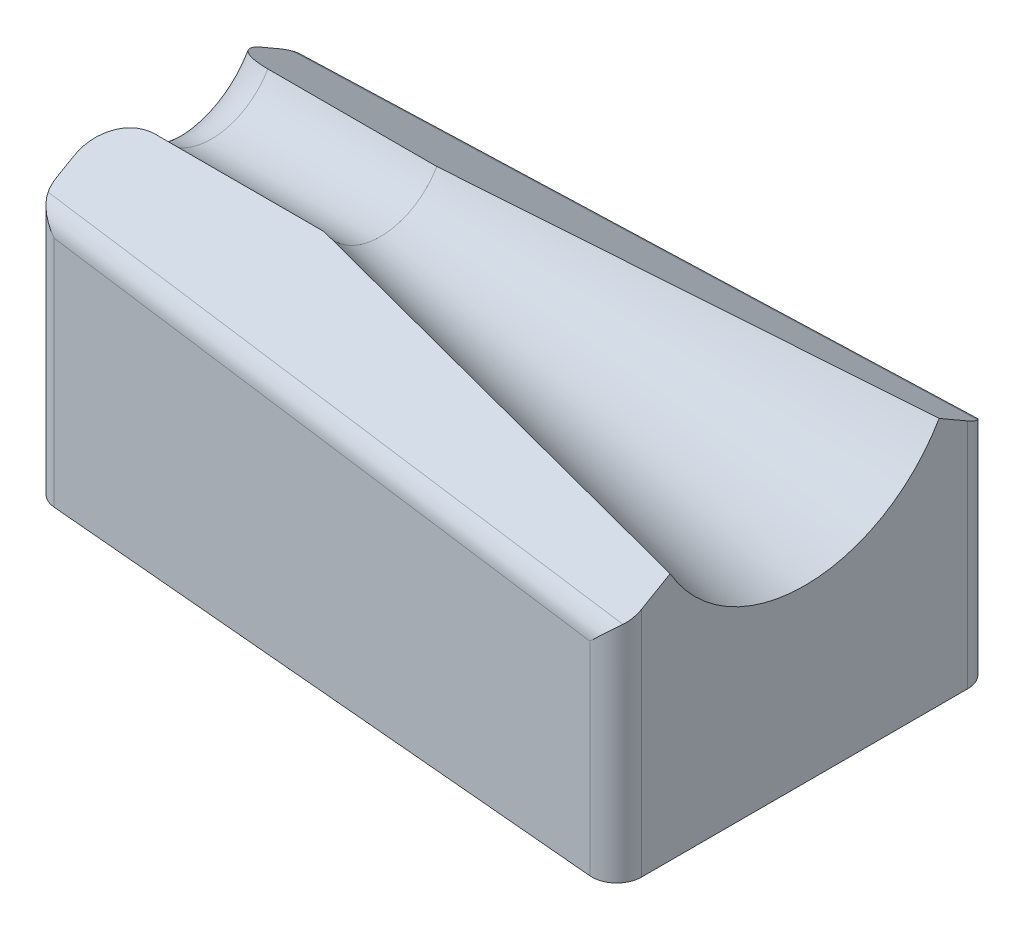
ISO-10303-21;
HEADER;
FILE_DESCRIPTION(('STEP AP214'),'2;1');
FILE_NAME('part.step','',(''),(''),'','','');
FILE_SCHEMA(('AUTOMOTIVE_DESIGN { 1 0 10303 214 1 1 1 1 }'));
ENDSEC;
DATA;
#1=APPLICATION_CONTEXT('core data for automotive mechanical design processes');
#2=APPLICATION_PROTOCOL_DEFINITION('international standard','automotive_design',2000,#1);
#3=PRODUCT_CONTEXT('',#1,'mechanical');
#4=PRODUCT('Part','Part','',(#3));
#5=PRODUCT_RELATED_PRODUCT_CATEGORY('part','',(#4));
#6=PRODUCT_DEFINITION_FORMATION('','',#4);
#7=PRODUCT_DEFINITION_CONTEXT('part definition',#1,'design');
#8=PRODUCT_DEFINITION('design','',#6,#7);
#9=PRODUCT_DEFINITION_SHAPE('','',#8);
#10=(LENGTH_UNIT() NAMED_UNIT(*) SI_UNIT(.MILLI.,.METRE.));
#11=(NAMED_UNIT(*) PLANE_ANGLE_UNIT() SI_UNIT($,.RADIAN.));
#12=(NAMED_UNIT(*) SI_UNIT($,.STERADIAN.) SOLID_ANGLE_UNIT());
#13=UNCERTAINTY_MEASURE_WITH_UNIT(LENGTH_MEASURE(1.E-05),#10,'distance_accuracy_value','');
#14=(GEOMETRIC_REPRESENTATION_CONTEXT(3) GLOBAL_UNCERTAINTY_ASSIGNED_CONTEXT((#13)) GLOBAL_UNIT_ASSIGNED_CONTEXT((#10,
#11,#12)) REPRESENTATION_CONTEXT('',''));
#15=CARTESIAN_POINT('',(0.,0.,0.));
#16=DIRECTION('',(0.,0.,1.));
#17=DIRECTION('',(1.,0.,0.));
#18=AXIS2_PLACEMENT_3D('',#15,#16,#17);
#19=CARTESIAN_POINT('',(103.375792349585,41.7202519652101,0.));
#20=DIRECTION('',(1.,0.,0.));
#21=DIRECTION('',(0.,0.,-1.));
#22=AXIS2_PLACEMENT_3D('',#19,#20,#21);
#23=CONICAL_SURFACE('',#22,31.75,0.20943951023932);
#24=CARTESIAN_POINT('',(16.636959168556,41.7202519652101,0.));
#25=DIRECTION('',(1.,0.,0.));
#26=DIRECTION('',(0.,0.,-1.));
#27=AXIS2_PLACEMENT_3D('',#24,#25,#26);
#28=CIRCLE('',#27,13.3130918557707);
#29=CARTESIAN_POINT('',(16.636959168556,35.0637060373248,11.5294757500131));
#30=VERTEX_POINT('',#29);
#31=CARTESIAN_POINT('',(16.636959168556,35.0637060373248,-11.5294757500131));
#32=VERTEX_POINT('',#31);
#33=EDGE_CURVE('E135',#30,#32,#28,.T.);
#34=ORIENTED_EDGE('',*,*,#33,.F.);
#35=DIRECTION('',(-0.978147600733805,0.10395584540888,-0.180056805991956));
#36=VECTOR('',#35,1.);
#37=CARTESIAN_POINT('',(16.636959168556,35.0637060373248,11.5294757500131));
#38=LINE('',#37,#36);
#39=CARTESIAN_POINT('',(103.375792349585,25.8452519652101,27.496306570156));
#40=VERTEX_POINT('',#39);
#41=EDGE_CURVE('E169',#40,#30,#38,.T.);
#42=ORIENTED_EDGE('',*,*,#41,.F.);
#43=CARTESIAN_POINT('',(103.375792349585,41.7202519652101,0.));
#44=DIRECTION('',(1.,0.,0.));
#45=DIRECTION('',(0.,0.,-1.));
#46=AXIS2_PLACEMENT_3D('',#43,#44,#45);
#47=CIRCLE('',#46,31.75);
#48=CARTESIAN_POINT('',(103.375792349585,25.8452519652101,-27.496306570156));
#49=VERTEX_POINT('',#48);
#50=EDGE_CURVE('E153',#40,#49,#47,.T.);
#51=ORIENTED_EDGE('',*,*,#50,.T.);
#52=DIRECTION('',(-0.978147600733805,0.10395584540888,0.180056805991956));
#53=VECTOR('',#52,1.);
#54=CARTESIAN_POINT('',(16.636959168556,35.0637060373248,-11.5294757500131));
#55=LINE('',#54,#53);
#56=EDGE_CURVE('E151',#49,#32,#55,.T.);
#57=ORIENTED_EDGE('',*,*,#56,.T.);
#58=EDGE_LOOP('',(#34,#42,#51,#57));
#59=FACE_BOUND('',#58,.T.);
#60=ADVANCED_FACE('F33',(#59),#23,.F.);
#61=CARTESIAN_POINT('',(103.375792349585,41.7202519652101,0.));
#62=DIRECTION('',(1.,0.,0.));
#63=DIRECTION('',(0.,0.,-1.));
#64=AXIS2_PLACEMENT_3D('',#61,#62,#63);
#65=CYLINDRICAL_SURFACE('',#64,13.3130918557707);
#66=CARTESIAN_POINT('',(-17.9092076504145,41.7202519652101,0.));
#67=DIRECTION('',(1.,0.,0.));
#68=DIRECTION('',(0.,0.,-1.));
#69=AXIS2_PLACEMENT_3D('',#66,#67,#68);
#70=CIRCLE('',#69,13.3130918557707);
#71=CARTESIAN_POINT('',(-17.9092076504145,35.0637060373248,11.5294757500131));
#72=VERTEX_POINT('',#71);
#73=CARTESIAN_POINT('',(-17.9092076504145,35.0637060373248,-11.5294757500131));
#74=VERTEX_POINT('',#73);
#75=EDGE_CURVE('E147',#72,#74,#70,.T.);
#76=ORIENTED_EDGE('',*,*,#75,.F.);
#77=DIRECTION('',(-1.,0.,0.));
#78=VECTOR('',#77,1.);
#79=CARTESIAN_POINT('',(-17.9092076504145,35.0637060373248,11.5294757500131));
#80=LINE('',#79,#78);
#81=EDGE_CURVE('E142',#30,#72,#80,.T.);
#82=ORIENTED_EDGE('',*,*,#81,.F.);
#83=ORIENTED_EDGE('',*,*,#33,.T.);
#84=DIRECTION('',(-1.,0.,0.));
#85=VECTOR('',#84,1.);
#86=CARTESIAN_POINT('',(-17.9092076504145,35.0637060373248,-11.5294757500131));
#87=LINE('',#86,#85);
#88=EDGE_CURVE('E139',#32,#74,#87,.T.);
#89=ORIENTED_EDGE('',*,*,#88,.T.);
#90=EDGE_LOOP('',(#76,#82,#83,#89));
#91=FACE_BOUND('',#90,.T.);
#92=ADVANCED_FACE('F137',(#91),#65,.F.);
#93=CARTESIAN_POINT('',(-17.9092076504146,41.7202519652101,0.));
#94=DIRECTION('',(1.,0.,0.));
#95=DIRECTION('',(0.,0.,-1.));
#96=AXIS2_PLACEMENT_3D('',#93,#94,#95);
#97=TOROIDAL_SURFACE('',#96,22.2030918557707,8.89);
#98=CARTESIAN_POINT('',(-26.7992076504145,41.7202519652101,0.));
#99=DIRECTION('',(1.,0.,0.));
#100=DIRECTION('',(0.,0.,-1.));
#101=AXIS2_PLACEMENT_3D('',#98,#99,#100);
#102=CIRCLE('',#101,22.2030918557707);
#103=CARTESIAN_POINT('',(-26.7992076504145,30.6187060373248,19.2284415896569));
#104=VERTEX_POINT('',#103);
#105=CARTESIAN_POINT('',(-26.7992076504145,30.6187060373248,-19.2284415896569));
#106=VERTEX_POINT('',#105);
#107=EDGE_CURVE('E179',#104,#106,#102,.T.);
#108=ORIENTED_EDGE('',*,*,#107,.F.);
#109=CARTESIAN_POINT('',(-17.9092076504146,30.6187060373248,19.2284415896568));
#110=DIRECTION('',(0.,0.86602540378444,0.499999999999998));
#111=DIRECTION('',(1.,0.,0.));
#112=AXIS2_PLACEMENT_3D('',#109,#110,#111);
#113=CIRCLE('',#112,8.89);
#114=EDGE_CURVE('E172',#72,#104,#113,.T.);
#115=ORIENTED_EDGE('',*,*,#114,.F.);
#116=ORIENTED_EDGE('',*,*,#75,.T.);
#117=CARTESIAN_POINT('',(-17.9092076504146,30.6187060373248,-19.2284415896568));
#118=DIRECTION('',(0.,-0.86602540378444,0.499999999999998));
#119=DIRECTION('',(1.,0.,0.));
#120=AXIS2_PLACEMENT_3D('',#117,#118,#119);
#121=CIRCLE('',#120,8.89);
#122=EDGE_CURVE('E161',#74,#106,#121,.T.);
#123=ORIENTED_EDGE('',*,*,#122,.T.);
#124=EDGE_LOOP('',(#108,#115,#116,#123));
#125=FACE_BOUND('',#124,.T.);
#126=ADVANCED_FACE('F253',(#125),#97,.T.);
#127=CARTESIAN_POINT('',(-26.7992076504145,30.6187060373248,19.2284415896569));
#128=DIRECTION('',(1.,0.,0.));
#129=DIRECTION('',(0.,0.,-1.));
#130=AXIS2_PLACEMENT_3D('',#127,#128,#129);
#131=PLANE('',#130);
#132=DIRECTION('',(0.,-0.499999999999998,-0.86602540378444));
#133=VECTOR('',#132,1.);
#134=CARTESIAN_POINT('',(-26.7992076504145,30.6187060373248,-19.2284415896569));
#135=LINE('',#134,#133);
#136=CARTESIAN_POINT('',(-26.7992076504145,28.532795739138,-22.8413442061475));
#137=VERTEX_POINT('',#136);
#138=EDGE_CURVE('E163',#106,#137,#135,.T.);
#139=ORIENTED_EDGE('',*,*,#138,.T.);
#140=DIRECTION('',(0.,1.,0.));
#141=VECTOR('',#140,1.);
#142=CARTESIAN_POINT('',(-26.7992076504145,30.6187060373248,-22.8413442061474));
#143=LINE('',#142,#141);
#144=CARTESIAN_POINT('',(-26.7992076504145,-24.9547480347899,-22.8413442061475));
#145=VERTEX_POINT('',#144);
#146=EDGE_CURVE('E11',#137,#145,#143,.F.);
#147=ORIENTED_EDGE('',*,*,#146,.T.);
#148=DIRECTION('',(0.,0.,1.));
#149=VECTOR('',#148,1.);
#150=CARTESIAN_POINT('',(-26.7992076504145,-24.9547480347899,-27.496306570156));
#151=LINE('',#150,#149);
#152=CARTESIAN_POINT('',(-26.7992076504145,-24.9547480347899,22.8413442061475));
#153=VERTEX_POINT('',#152);
#154=EDGE_CURVE('E233',#145,#153,#151,.T.);
#155=ORIENTED_EDGE('',*,*,#154,.T.);
#156=DIRECTION('',(0.,-1.,0.));
#157=VECTOR('',#156,1.);
#158=CARTESIAN_POINT('',(-26.7992076504145,30.6187060373248,22.8413442061475));
#159=LINE('',#158,#157);
#160=CARTESIAN_POINT('',(-26.7992076504145,28.532795739138,22.8413442061475));
#161=VERTEX_POINT('',#160);
#162=EDGE_CURVE('E42',#153,#161,#159,.F.);
#163=ORIENTED_EDGE('',*,*,#162,.T.);
#164=DIRECTION('',(0.,-0.499999999999998,0.86602540378444));
#165=VECTOR('',#164,1.);
#166=CARTESIAN_POINT('',(-26.7992076504145,30.6187060373248,19.2284415896569));
#167=LINE('',#166,#165);
#168=EDGE_CURVE('E175',#104,#161,#167,.T.);
#169=ORIENTED_EDGE('',*,*,#168,.F.);
#170=ORIENTED_EDGE('',*,*,#107,.T.);
#171=EDGE_LOOP('',(#139,#147,#155,#163,#169,#170));
#172=FACE_BOUND('',#171,.T.);
#173=ADVANCED_FACE('F247',(#172),#131,.F.);
#174=CARTESIAN_POINT('',(-17.9092076504146,30.6187060373248,19.2284415896568));
#175=DIRECTION('',(0.,0.86602540378444,0.499999999999998));
#176=DIRECTION('',(1.,0.,0.));
#177=AXIS2_PLACEMENT_3D('',#174,#175,#176);
#178=PLANE('',#177);
#179=DIRECTION('',(-0.994935885120892,0.050255806875196,-0.0870456108832093));
#180=VECTOR('',#179,1.);
#181=CARTESIAN_POINT('',(103.671334674282,20.7326487066491,36.3515951729259));
#182=LINE('',#181,#180);
#183=CARTESIAN_POINT('',(-26.3279538476279,27.2991212156552,24.9781311608231));
#184=VERTEX_POINT('',#183);
#185=CARTESIAN_POINT('',(102.463472175525,20.7936597781936,36.2459208971866));
#186=VERTEX_POINT('',#185);
#187=EDGE_CURVE('E213',#184,#186,#182,.F.);
#188=ORIENTED_EDGE('',*,*,#187,.T.);
#189=CARTESIAN_POINT('',(98.2957923495854,22.4706456525585,33.3412961592112));
#190=DIRECTION('',(0.,0.86602540378444,0.499999999999998));
#191=DIRECTION('',(0.,-0.499999999999998,0.86602540378444));
#192=AXIS2_PLACEMENT_3D('',#189,#190,#191);
#193=ELLIPSE('',#192,5.86587873496659,5.08);
#194=CARTESIAN_POINT('',(103.375792349585,22.4706456525585,33.3412961592112));
#195=VERTEX_POINT('',#194);
#196=EDGE_CURVE('E215',#186,#195,#193,.T.);
#197=ORIENTED_EDGE('',*,*,#196,.T.);
#198=DIRECTION('',(0.,-0.499999999999998,0.86602540378444));
#199=VECTOR('',#198,1.);
#200=CARTESIAN_POINT('',(103.375792349585,41.7202519652101,0.));
#201=LINE('',#200,#199);
#202=EDGE_CURVE('E146',#40,#195,#201,.T.);
#203=ORIENTED_EDGE('',*,*,#202,.F.);
#204=ORIENTED_EDGE('',*,*,#41,.T.);
#205=ORIENTED_EDGE('',*,*,#81,.T.);
#206=ORIENTED_EDGE('',*,*,#114,.T.);
#207=ORIENTED_EDGE('',*,*,#168,.T.);
#208=CARTESIAN_POINT('',(-21.7192076504145,28.532795739138,22.8413442061475));
#209=DIRECTION('',(0.,0.86602540378444,0.499999999999998));
#210=DIRECTION('',(0.,-0.499999999999998,0.86602540378444));
#211=AXIS2_PLACEMENT_3D('',#208,#209,#210);
#212=ELLIPSE('',#211,5.86587873496659,5.08);
#213=EDGE_CURVE('E211',#161,#184,#212,.T.);
#214=ORIENTED_EDGE('',*,*,#213,.T.);
#215=EDGE_LOOP('',(#188,#197,#203,#204,#205,#206,#207,#214));
#216=FACE_BOUND('',#215,.T.);
#217=ADVANCED_FACE('F255',(#216),#178,.T.);
#218=CARTESIAN_POINT('',(-17.9092076504146,30.6187060373248,-19.2284415896568));
#219=DIRECTION('',(0.,-0.86602540378444,0.499999999999998));
#220=DIRECTION('',(1.,0.,0.));
#221=AXIS2_PLACEMENT_3D('',#218,#219,#220);
#222=PLANE('',#221);
#223=DIRECTION('',(0.,-0.499999999999998,-0.86602540378444));
#224=VECTOR('',#223,1.);
#225=CARTESIAN_POINT('',(103.375792349585,41.7202519652101,0.));
#226=LINE('',#225,#224);
#227=CARTESIAN_POINT('',(103.375792349585,22.4706456525585,-33.3412961592112));
#228=VERTEX_POINT('',#227);
#229=EDGE_CURVE('E187',#49,#228,#226,.T.);
#230=ORIENTED_EDGE('',*,*,#229,.T.);
#231=CARTESIAN_POINT('',(98.2957923495854,22.4706456525585,-33.3412961592112));
#232=DIRECTION('',(0.,-0.86602540378444,0.499999999999998));
#233=DIRECTION('',(0.,0.499999999999998,0.86602540378444));
#234=AXIS2_PLACEMENT_3D('',#231,#232,#233);
#235=ELLIPSE('',#234,5.86587873496659,5.08);
#236=CARTESIAN_POINT('',(102.463472175525,20.7936597781936,-36.2459208971866));
#237=VERTEX_POINT('',#236);
#238=EDGE_CURVE('E221',#228,#237,#235,.F.);
#239=ORIENTED_EDGE('',*,*,#238,.T.);
#240=DIRECTION('',(-0.994935885120892,0.050255806875196,0.0870456108832092));
#241=VECTOR('',#240,1.);
#242=CARTESIAN_POINT('',(-18.6581930470513,26.9117092996342,-25.649148282829));
#243=LINE('',#242,#241);
#244=CARTESIAN_POINT('',(-26.3279538476279,27.2991212156552,-24.9781311608231));
#245=VERTEX_POINT('',#244);
#246=EDGE_CURVE('E219',#237,#245,#243,.T.);
#247=ORIENTED_EDGE('',*,*,#246,.T.);
#248=CARTESIAN_POINT('',(-21.7192076504145,28.532795739138,-22.8413442061474));
#249=DIRECTION('',(0.,-0.86602540378444,0.499999999999998));
#250=DIRECTION('',(0.,0.499999999999998,0.86602540378444));
#251=AXIS2_PLACEMENT_3D('',#248,#249,#250);
#252=ELLIPSE('',#251,5.86587873496659,5.08);
#253=EDGE_CURVE('E217',#245,#137,#252,.F.);
#254=ORIENTED_EDGE('',*,*,#253,.T.);
#255=ORIENTED_EDGE('',*,*,#138,.F.);
#256=ORIENTED_EDGE('',*,*,#122,.F.);
#257=ORIENTED_EDGE('',*,*,#88,.F.);
#258=ORIENTED_EDGE('',*,*,#56,.F.);
#259=EDGE_LOOP('',(#230,#239,#247,#254,#255,#256,#257,#258));
#260=FACE_BOUND('',#259,.T.);
#261=ADVANCED_FACE('F158',(#260),#222,.F.);
#262=CARTESIAN_POINT('',(-26.7992076504145,-24.9547480347899,27.496306570156));
#263=DIRECTION('',(-0.0871557427476584,0.,0.996194698091746));
#264=DIRECTION('',(0.996194698091746,0.,0.0871557427476584));
#265=AXIS2_PLACEMENT_3D('',#262,#263,#264);
#266=PLANE('',#265);
#267=DIRECTION('',(0.996194698091746,0.,0.0871557427476584));
#268=VECTOR('',#267,1.);
#269=CARTESIAN_POINT('',(97.6122834452887,-24.9547480347899,38.3809016533865));
#270=LINE('',#269,#268);
#271=CARTESIAN_POINT('',(97.8530411764273,-24.9547480347899,38.4019652255173));
#272=VERTEX_POINT('',#271);
#273=CARTESIAN_POINT('',(-22.1619588235727,-24.9547480347899,27.9020132724535));
#274=VERTEX_POINT('',#273);
#275=EDGE_CURVE('E156',#272,#274,#270,.F.);
#276=ORIENTED_EDGE('',*,*,#275,.F.);
#277=DIRECTION('',(0.,-1.,0.));
#278=VECTOR('',#277,1.);
#279=CARTESIAN_POINT('',(97.8530411764273,19.2699039877033,38.4019652255173));
#280=LINE('',#279,#278);
#281=CARTESIAN_POINT('',(97.8530411764273,16.6047669175919,38.4019652255173));
#282=VERTEX_POINT('',#281);
#283=EDGE_CURVE('E209',#272,#282,#280,.F.);
#284=ORIENTED_EDGE('',*,*,#283,.T.);
#285=DIRECTION('',(0.994935885120892,-0.050255806875196,0.0870456108832093));
#286=VECTOR('',#285,1.);
#287=CARTESIAN_POINT('',(-26.9464164988765,22.908587632931,27.4834274647448));
#288=LINE('',#287,#286);
#289=CARTESIAN_POINT('',(-22.1619588235727,22.6669170041714,27.9020132724535));
#290=VERTEX_POINT('',#289);
#291=EDGE_CURVE('E207',#282,#290,#288,.F.);
#292=ORIENTED_EDGE('',*,*,#291,.T.);
#293=DIRECTION('',(0.,1.,0.));
#294=VECTOR('',#293,1.);
#295=CARTESIAN_POINT('',(-22.1619588235727,-24.9547480347899,27.9020132724535));
#296=LINE('',#295,#294);
#297=EDGE_CURVE('E205',#290,#274,#296,.F.);
#298=ORIENTED_EDGE('',*,*,#297,.T.);
#299=EDGE_LOOP('',(#276,#284,#292,#298));
#300=FACE_BOUND('',#299,.T.);
#301=ADVANCED_FACE('F286',(#300),#266,.T.);
#302=CARTESIAN_POINT('',(103.375792349585,-24.9547480347899,-27.496306570156));
#303=DIRECTION('',(0.,1.,0.));
#304=DIRECTION('',(0.,0.,1.));
#305=AXIS2_PLACEMENT_3D('',#302,#303,#304);
#306=PLANE('',#305);
#307=DIRECTION('',(0.,0.,-1.));
#308=VECTOR('',#307,1.);
#309=CARTESIAN_POINT('',(103.375792349585,-24.9547480347899,-27.496306570156));
#310=LINE('',#309,#308);
#311=CARTESIAN_POINT('',(103.375792349585,-24.9547480347899,33.3412961592112));
#312=VERTEX_POINT('',#311);
#313=CARTESIAN_POINT('',(103.375792349585,-24.9547480347899,-33.3412961592112));
#314=VERTEX_POINT('',#313);
#315=EDGE_CURVE('E189',#312,#314,#310,.T.);
#316=ORIENTED_EDGE('',*,*,#315,.F.);
#317=CARTESIAN_POINT('',(98.2957923495854,-24.9547480347899,33.3412961592112));
#318=DIRECTION('',(0.,1.,0.));
#319=DIRECTION('',(0.,0.,1.));
#320=AXIS2_PLACEMENT_3D('',#317,#318,#319);
#321=CIRCLE('',#320,5.08);
#322=EDGE_CURVE('E203',#312,#272,#321,.F.);
#323=ORIENTED_EDGE('',*,*,#322,.T.);
#324=ORIENTED_EDGE('',*,*,#275,.T.);
#325=CARTESIAN_POINT('',(-21.7192076504145,-24.9547480347899,22.8413442061475));
#326=DIRECTION('',(0.,1.,0.));
#327=DIRECTION('',(0.,0.,1.));
#328=AXIS2_PLACEMENT_3D('',#325,#326,#327);
#329=CIRCLE('',#328,5.08);
#330=EDGE_CURVE('E197',#274,#153,#329,.F.);
#331=ORIENTED_EDGE('',*,*,#330,.T.);
#332=ORIENTED_EDGE('',*,*,#154,.F.);
#333=CARTESIAN_POINT('',(-21.7192076504145,-24.9547480347899,-22.8413442061475));
#334=DIRECTION('',(0.,1.,0.));
#335=DIRECTION('',(0.,0.,1.));
#336=AXIS2_PLACEMENT_3D('',#333,#334,#335);
#337=CIRCLE('',#336,5.08);
#338=CARTESIAN_POINT('',(-22.1619588235727,-24.9547480347899,-27.9020132724535));
#339=VERTEX_POINT('',#338);
#340=EDGE_CURVE('E199',#145,#339,#337,.F.);
#341=ORIENTED_EDGE('',*,*,#340,.T.);
#342=DIRECTION('',(0.996194698091746,0.,-0.0871557427476584));
#343=VECTOR('',#342,1.);
#344=CARTESIAN_POINT('',(-26.7992076504145,-24.9547480347899,-27.496306570156));
#345=LINE('',#344,#343);
#346=CARTESIAN_POINT('',(97.8530411764274,-24.9547480347899,-38.4019652255173));
#347=VERTEX_POINT('',#346);
#348=EDGE_CURVE('E184',#347,#339,#345,.F.);
#349=ORIENTED_EDGE('',*,*,#348,.F.);
#350=CARTESIAN_POINT('',(98.2957923495854,-24.9547480347899,-33.3412961592112));
#351=DIRECTION('',(0.,1.,0.));
#352=DIRECTION('',(0.,0.,1.));
#353=AXIS2_PLACEMENT_3D('',#350,#351,#352);
#354=CIRCLE('',#353,5.08);
#355=EDGE_CURVE('E201',#347,#314,#354,.F.);
#356=ORIENTED_EDGE('',*,*,#355,.T.);
#357=EDGE_LOOP('',(#316,#323,#324,#331,#332,#341,#349,#356));
#358=FACE_BOUND('',#357,.T.);
#359=ADVANCED_FACE('F266',(#358),#306,.F.);
#360=CARTESIAN_POINT('',(-26.7992076504145,25.8452519652101,-27.496306570156));
#361=DIRECTION('',(-0.0871557427476584,0.,-0.996194698091746));
#362=DIRECTION('',(-0.996194698091746,0.,0.0871557427476584));
#363=AXIS2_PLACEMENT_3D('',#360,#361,#362);
#364=PLANE('',#363);
#365=DIRECTION('',(0.994935885120892,-0.050255806875196,-0.0870456108832093));
#366=VECTOR('',#365,1.);
#367=CARTESIAN_POINT('',(-26.9464164988765,22.908587632931,-27.4834274647448));
#368=LINE('',#367,#366);
#369=CARTESIAN_POINT('',(-22.1619588235727,22.6669170041714,-27.9020132724535));
#370=VERTEX_POINT('',#369);
#371=CARTESIAN_POINT('',(97.8530411764273,16.6047669175919,-38.4019652255173));
#372=VERTEX_POINT('',#371);
#373=EDGE_CURVE('E50',#370,#372,#368,.T.);
#374=ORIENTED_EDGE('',*,*,#373,.T.);
#375=DIRECTION('',(0.,1.,0.));
#376=VECTOR('',#375,1.);
#377=CARTESIAN_POINT('',(97.8530411764273,-24.9547480347899,-38.4019652255173));
#378=LINE('',#377,#376);
#379=EDGE_CURVE('E225',#372,#347,#378,.F.);
#380=ORIENTED_EDGE('',*,*,#379,.T.);
#381=ORIENTED_EDGE('',*,*,#348,.T.);
#382=DIRECTION('',(0.,-1.,0.));
#383=VECTOR('',#382,1.);
#384=CARTESIAN_POINT('',(-22.1619588235727,25.8452519652101,-27.9020132724535));
#385=LINE('',#384,#383);
#386=EDGE_CURVE('E55',#339,#370,#385,.F.);
#387=ORIENTED_EDGE('',*,*,#386,.T.);
#388=EDGE_LOOP('',(#374,#380,#381,#387));
#389=FACE_BOUND('',#388,.T.);
#390=ADVANCED_FACE('F293',(#389),#364,.T.);
#391=CARTESIAN_POINT('',(103.375792349585,41.7202519652101,0.));
#392=DIRECTION('',(1.,0.,0.));
#393=DIRECTION('',(0.,0.,-1.));
#394=AXIS2_PLACEMENT_3D('',#391,#392,#393);
#395=PLANE('',#394);
#396=ORIENTED_EDGE('',*,*,#202,.T.);
#397=DIRECTION('',(0.,1.,0.));
#398=VECTOR('',#397,1.);
#399=CARTESIAN_POINT('',(103.375792349585,-24.9547480347899,33.3412961592112));
#400=LINE('',#399,#398);
#401=EDGE_CURVE('E194',#195,#312,#400,.F.);
#402=ORIENTED_EDGE('',*,*,#401,.T.);
#403=ORIENTED_EDGE('',*,*,#315,.T.);
#404=DIRECTION('',(0.,-1.,0.));
#405=VECTOR('',#404,1.);
#406=CARTESIAN_POINT('',(103.375792349585,19.2699039877033,-33.3412961592112));
#407=LINE('',#406,#405);
#408=EDGE_CURVE('E191',#314,#228,#407,.F.);
#409=ORIENTED_EDGE('',*,*,#408,.T.);
#410=ORIENTED_EDGE('',*,*,#229,.F.);
#411=ORIENTED_EDGE('',*,*,#50,.F.);
#412=EDGE_LOOP('',(#396,#402,#403,#409,#410,#411));
#413=FACE_BOUND('',#412,.T.);
#414=ADVANCED_FACE('F257',(#413),#395,.T.);
#415=CARTESIAN_POINT('',(-21.7192076504145,30.6187060373248,22.8413442061475));
#416=DIRECTION('',(0.,-1.,0.));
#417=DIRECTION('',(0.,0.,-1.));
#418=AXIS2_PLACEMENT_3D('',#415,#416,#417);
#419=CYLINDRICAL_SURFACE('',#418,5.08);
#420=ORIENTED_EDGE('',*,*,#330,.F.);
#421=ORIENTED_EDGE('',*,*,#297,.F.);
#422=CARTESIAN_POINT('',(-21.7192076504145,22.6669170041714,22.8413442061475));
#423=DIRECTION('',(-0.721899554670174,-0.689109640450924,-0.0631580272380533));
#424=DIRECTION('',(0.68648737022112,-0.724657093691629,0.0600598625480721));
#425=AXIS2_PLACEMENT_3D('',#422,#423,#424);
#426=ELLIPSE('',#425,7.37183127589953,5.08);
#427=EDGE_CURVE('E231',#184,#290,#426,.F.);
#428=ORIENTED_EDGE('',*,*,#427,.F.);
#429=ORIENTED_EDGE('',*,*,#213,.F.);
#430=ORIENTED_EDGE('',*,*,#162,.F.);
#431=EDGE_LOOP('',(#420,#421,#428,#429,#430));
#432=FACE_BOUND('',#431,.T.);
#433=ADVANCED_FACE('F272',(#432),#419,.T.);
#434=CARTESIAN_POINT('',(-18.6581930470513,22.5123002484092,23.109148282829));
#435=DIRECTION('',(0.994935885120891,-0.050255806875196,0.0870456108832092));
#436=DIRECTION('',(0.0871557427476584,0.,-0.996194698091746));
#437=AXIS2_PLACEMENT_3D('',#434,#435,#436);
#438=CYLINDRICAL_SURFACE('',#437,5.08);
#439=ORIENTED_EDGE('',*,*,#427,.T.);
#440=ORIENTED_EDGE('',*,*,#291,.F.);
#441=CARTESIAN_POINT('',(98.2957923495854,16.6047669175919,33.3412961592112));
#442=DIRECTION('',(0.68648737022112,-0.724657093691629,0.0600598625480721));
#443=DIRECTION('',(0.721899554670174,0.689109640450924,0.0631580272380533));
#444=AXIS2_PLACEMENT_3D('',#441,#442,#443);
#445=ELLIPSE('',#444,7.0102122013612,5.08);
#446=EDGE_CURVE('E228',#186,#282,#445,.T.);
#447=ORIENTED_EDGE('',*,*,#446,.F.);
#448=ORIENTED_EDGE('',*,*,#187,.F.);
#449=EDGE_LOOP('',(#439,#440,#447,#448));
#450=FACE_BOUND('',#449,.T.);
#451=ADVANCED_FACE('F280',(#450),#438,.T.);
#452=CARTESIAN_POINT('',(98.2957923495854,41.7202519652101,33.3412961592112));
#453=DIRECTION('',(0.,-1.,0.));
#454=DIRECTION('',(0.,0.,-1.));
#455=AXIS2_PLACEMENT_3D('',#452,#453,#454);
#456=CYLINDRICAL_SURFACE('',#455,5.08);
#457=ORIENTED_EDGE('',*,*,#446,.T.);
#458=ORIENTED_EDGE('',*,*,#283,.F.);
#459=ORIENTED_EDGE('',*,*,#322,.F.);
#460=ORIENTED_EDGE('',*,*,#401,.F.);
#461=ORIENTED_EDGE('',*,*,#196,.F.);
#462=EDGE_LOOP('',(#457,#458,#459,#460,#461));
#463=FACE_BOUND('',#462,.T.);
#464=ADVANCED_FACE('F283',(#463),#456,.T.);
#465=CARTESIAN_POINT('',(-21.7192076504145,30.6187060373248,-22.8413442061474));
#466=DIRECTION('',(0.,1.,0.));
#467=DIRECTION('',(0.,0.,1.));
#468=AXIS2_PLACEMENT_3D('',#465,#466,#467);
#469=CYLINDRICAL_SURFACE('',#468,5.08);
#470=ORIENTED_EDGE('',*,*,#146,.F.);
#471=ORIENTED_EDGE('',*,*,#253,.F.);
#472=CARTESIAN_POINT('',(-21.7192076504145,22.6669170041714,-22.8413442061475));
#473=DIRECTION('',(0.721899554670174,0.689109640450924,-0.0631580272380532));
#474=DIRECTION('',(-0.68648737022112,0.724657093691629,0.0600598625480722));
#475=AXIS2_PLACEMENT_3D('',#472,#473,#474);
#476=ELLIPSE('',#475,7.37183127589953,5.08);
#477=EDGE_CURVE('E37',#370,#245,#476,.T.);
#478=ORIENTED_EDGE('',*,*,#477,.F.);
#479=ORIENTED_EDGE('',*,*,#386,.F.);
#480=ORIENTED_EDGE('',*,*,#340,.F.);
#481=EDGE_LOOP('',(#470,#471,#478,#479,#480));
#482=FACE_BOUND('',#481,.T.);
#483=ADVANCED_FACE('F35',(#482),#469,.T.);
#484=CARTESIAN_POINT('',(-26.5036653257184,22.908587632931,-22.4227583984388));
#485=DIRECTION('',(-0.994935885120891,0.050255806875196,0.0870456108832093));
#486=DIRECTION('',(0.0871557427476584,0.,0.996194698091746));
#487=AXIS2_PLACEMENT_3D('',#484,#485,#486);
#488=CYLINDRICAL_SURFACE('',#487,5.08);
#489=ORIENTED_EDGE('',*,*,#477,.T.);
#490=ORIENTED_EDGE('',*,*,#246,.F.);
#491=CARTESIAN_POINT('',(98.2957923495854,16.6047669175919,-33.3412961592112));
#492=DIRECTION('',(-0.68648737022112,0.724657093691629,0.0600598625480722));
#493=DIRECTION('',(-0.721899554670174,-0.689109640450924,0.0631580272380532));
#494=AXIS2_PLACEMENT_3D('',#491,#492,#493);
#495=ELLIPSE('',#494,7.0102122013612,5.08);
#496=EDGE_CURVE('E234',#372,#237,#495,.F.);
#497=ORIENTED_EDGE('',*,*,#496,.F.);
#498=ORIENTED_EDGE('',*,*,#373,.F.);
#499=EDGE_LOOP('',(#489,#490,#497,#498));
#500=FACE_BOUND('',#499,.T.);
#501=ADVANCED_FACE('F241',(#500),#488,.T.);
#502=CARTESIAN_POINT('',(98.2957923495854,41.7202519652101,-33.3412961592112));
#503=DIRECTION('',(0.,1.,0.));
#504=DIRECTION('',(0.,0.,1.));
#505=AXIS2_PLACEMENT_3D('',#502,#503,#504);
#506=CYLINDRICAL_SURFACE('',#505,5.08);
#507=ORIENTED_EDGE('',*,*,#355,.F.);
#508=ORIENTED_EDGE('',*,*,#379,.F.);
#509=ORIENTED_EDGE('',*,*,#496,.T.);
#510=ORIENTED_EDGE('',*,*,#238,.F.);
#511=ORIENTED_EDGE('',*,*,#408,.F.);
#512=EDGE_LOOP('',(#507,#508,#509,#510,#511));
#513=FACE_BOUND('',#512,.T.);
#514=ADVANCED_FACE('F262',(#513),#506,.T.);
#515=CLOSED_SHELL('',(#60,#92,#126,#173,#217,#261,#301,#359,#390,#414,#433,#451,#464,#483,#501,#514));
#516=MANIFOLD_SOLID_BREP('B2',#515);
#517=ADVANCED_BREP_SHAPE_REPRESENTATION('',(#18,#516),#14);
#518=SHAPE_DEFINITION_REPRESENTATION(#9,#517);
ENDSEC;
END-ISO-10303-21;
